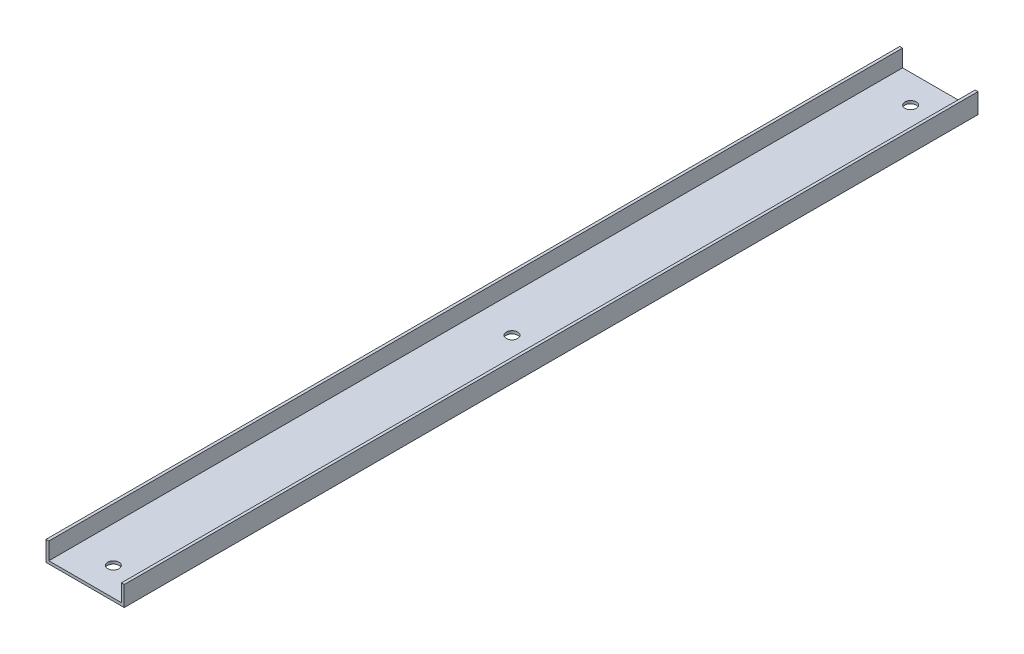
ISO-10303-21;
HEADER;
FILE_DESCRIPTION(('STEP AP214'),'2;1');
FILE_NAME('part.step','',(''),(''),'','','');
FILE_SCHEMA(('AUTOMOTIVE_DESIGN { 1 0 10303 214 1 1 1 1 }'));
ENDSEC;
DATA;
#1=APPLICATION_CONTEXT('core data for automotive mechanical design processes');
#2=APPLICATION_PROTOCOL_DEFINITION('international standard','automotive_design',2000,#1);
#3=PRODUCT_CONTEXT('',#1,'mechanical');
#4=PRODUCT('Part','Part','',(#3));
#5=PRODUCT_RELATED_PRODUCT_CATEGORY('part','',(#4));
#6=PRODUCT_DEFINITION_FORMATION('','',#4);
#7=PRODUCT_DEFINITION_CONTEXT('part definition',#1,'design');
#8=PRODUCT_DEFINITION('design','',#6,#7);
#9=PRODUCT_DEFINITION_SHAPE('','',#8);
#10=(LENGTH_UNIT() NAMED_UNIT(*) SI_UNIT(.MILLI.,.METRE.));
#11=(NAMED_UNIT(*) PLANE_ANGLE_UNIT() SI_UNIT($,.RADIAN.));
#12=(NAMED_UNIT(*) SI_UNIT($,.STERADIAN.) SOLID_ANGLE_UNIT());
#13=UNCERTAINTY_MEASURE_WITH_UNIT(LENGTH_MEASURE(1.E-05),#10,'distance_accuracy_value','');
#14=(GEOMETRIC_REPRESENTATION_CONTEXT(3) GLOBAL_UNCERTAINTY_ASSIGNED_CONTEXT((#13)) GLOBAL_UNIT_ASSIGNED_CONTEXT((#10,
#11,#12)) REPRESENTATION_CONTEXT('',''));
#15=CARTESIAN_POINT('',(0.,0.,0.));
#16=DIRECTION('',(0.,0.,1.));
#17=DIRECTION('',(1.,0.,0.));
#18=AXIS2_PLACEMENT_3D('',#15,#16,#17);
#19=CARTESIAN_POINT('',(1.27,0.,384.175));
#20=DIRECTION('',(0.,-1.,0.));
#21=DIRECTION('',(0.,0.,-1.));
#22=AXIS2_PLACEMENT_3D('',#19,#20,#21);
#23=PLANE('',#22);
#24=DIRECTION('',(-1.,0.,0.));
#25=VECTOR('',#24,1.);
#26=CARTESIAN_POINT('',(1.27,0.,0.));
#27=LINE('',#26,#25);
#28=CARTESIAN_POINT('',(1.27,0.,0.));
#29=VERTEX_POINT('',#28);
#30=CARTESIAN_POINT('',(0.,0.,0.));
#31=VERTEX_POINT('',#30);
#32=EDGE_CURVE('E129',#29,#31,#27,.T.);
#33=ORIENTED_EDGE('',*,*,#32,.T.);
#34=DIRECTION('',(0.,0.,-1.));
#35=VECTOR('',#34,1.);
#36=CARTESIAN_POINT('',(0.,0.,384.175));
#37=LINE('',#36,#35);
#38=CARTESIAN_POINT('',(0.,0.,384.175));
#39=VERTEX_POINT('',#38);
#40=EDGE_CURVE('E11',#39,#31,#37,.T.);
#41=ORIENTED_EDGE('',*,*,#40,.F.);
#42=DIRECTION('',(-1.,0.,0.));
#43=VECTOR('',#42,1.);
#44=CARTESIAN_POINT('',(1.27,0.,384.175));
#45=LINE('',#44,#43);
#46=CARTESIAN_POINT('',(1.27,0.,384.175));
#47=VERTEX_POINT('',#46);
#48=EDGE_CURVE('E144',#47,#39,#45,.T.);
#49=ORIENTED_EDGE('',*,*,#48,.F.);
#50=DIRECTION('',(0.,0.,-1.));
#51=VECTOR('',#50,1.);
#52=CARTESIAN_POINT('',(1.27,0.,384.175));
#53=LINE('',#52,#51);
#54=EDGE_CURVE('E125',#47,#29,#53,.T.);
#55=ORIENTED_EDGE('',*,*,#54,.T.);
#56=EDGE_LOOP('',(#33,#41,#49,#55));
#57=FACE_BOUND('',#56,.T.);
#58=ADVANCED_FACE('F33',(#57),#23,.F.);
#59=CARTESIAN_POINT('',(0.,0.,384.175));
#60=DIRECTION('',(1.,0.,0.));
#61=DIRECTION('',(0.,1.,0.));
#62=AXIS2_PLACEMENT_3D('',#59,#60,#61);
#63=PLANE('',#62);
#64=DIRECTION('',(0.,-1.,0.));
#65=VECTOR('',#64,1.);
#66=CARTESIAN_POINT('',(0.,0.,0.));
#67=LINE('',#66,#65);
#68=CARTESIAN_POINT('',(0.,-8.9916,0.));
#69=VERTEX_POINT('',#68);
#70=EDGE_CURVE('E132',#31,#69,#67,.T.);
#71=ORIENTED_EDGE('',*,*,#70,.T.);
#72=DIRECTION('',(0.,0.,-1.));
#73=VECTOR('',#72,1.);
#74=CARTESIAN_POINT('',(0.,-8.9916,384.175));
#75=LINE('',#74,#73);
#76=CARTESIAN_POINT('',(0.,-8.9916,384.175));
#77=VERTEX_POINT('',#76);
#78=EDGE_CURVE('E41',#77,#69,#75,.T.);
#79=ORIENTED_EDGE('',*,*,#78,.F.);
#80=DIRECTION('',(0.,-1.,0.));
#81=VECTOR('',#80,1.);
#82=CARTESIAN_POINT('',(0.,0.,384.175));
#83=LINE('',#82,#81);
#84=EDGE_CURVE('E92',#39,#77,#83,.T.);
#85=ORIENTED_EDGE('',*,*,#84,.F.);
#86=ORIENTED_EDGE('',*,*,#40,.T.);
#87=EDGE_LOOP('',(#71,#79,#85,#86));
#88=FACE_BOUND('',#87,.T.);
#89=ADVANCED_FACE('F206',(#88),#63,.F.);
#90=CARTESIAN_POINT('',(0.,-8.9916,384.175));
#91=DIRECTION('',(0.,1.,0.));
#92=DIRECTION('',(-1.,0.,0.));
#93=AXIS2_PLACEMENT_3D('',#90,#91,#92);
#94=PLANE('',#93);
#95=CARTESIAN_POINT('',(17.6022,-8.9916,371.475));
#96=DIRECTION('',(0.,-1.,0.));
#97=DIRECTION('',(0.,0.,-1.));
#98=AXIS2_PLACEMENT_3D('',#95,#96,#97);
#99=CIRCLE('',#98,2.54000000000001);
#100=CARTESIAN_POINT('',(17.6022,-8.9916,368.935));
#101=VERTEX_POINT('',#100);
#102=EDGE_CURVE('E189',#101,#101,#99,.T.);
#103=ORIENTED_EDGE('',*,*,#102,.F.);
#104=EDGE_LOOP('',(#103));
#105=FACE_BOUND('',#104,.T.);
#106=CARTESIAN_POINT('',(17.6022,-8.9916,192.0875));
#107=DIRECTION('',(0.,-1.,0.));
#108=DIRECTION('',(0.,0.,-1.));
#109=AXIS2_PLACEMENT_3D('',#106,#107,#108);
#110=CIRCLE('',#109,2.54);
#111=CARTESIAN_POINT('',(17.6022,-8.9916,189.5475));
#112=VERTEX_POINT('',#111);
#113=EDGE_CURVE('E183',#112,#112,#110,.T.);
#114=ORIENTED_EDGE('',*,*,#113,.F.);
#115=EDGE_LOOP('',(#114));
#116=FACE_BOUND('',#115,.T.);
#117=CARTESIAN_POINT('',(17.6022,-8.9916,12.7));
#118=DIRECTION('',(0.,-1.,0.));
#119=DIRECTION('',(0.,0.,-1.));
#120=AXIS2_PLACEMENT_3D('',#117,#118,#119);
#121=CIRCLE('',#120,2.54);
#122=CARTESIAN_POINT('',(17.6022,-8.9916,10.16));
#123=VERTEX_POINT('',#122);
#124=EDGE_CURVE('E177',#123,#123,#121,.T.);
#125=ORIENTED_EDGE('',*,*,#124,.F.);
#126=EDGE_LOOP('',(#125));
#127=FACE_BOUND('',#126,.T.);
#128=DIRECTION('',(1.,0.,0.));
#129=VECTOR('',#128,1.);
#130=CARTESIAN_POINT('',(0.,-8.9916,0.));
#131=LINE('',#130,#129);
#132=CARTESIAN_POINT('',(35.2044,-8.99159999999999,0.));
#133=VERTEX_POINT('',#132);
#134=EDGE_CURVE('E135',#69,#133,#131,.T.);
#135=ORIENTED_EDGE('',*,*,#134,.T.);
#136=DIRECTION('',(0.,0.,-1.));
#137=VECTOR('',#136,1.);
#138=CARTESIAN_POINT('',(35.2044,-8.99159999999999,384.175));
#139=LINE('',#138,#137);
#140=CARTESIAN_POINT('',(35.2044,-8.99159999999999,384.175));
#141=VERTEX_POINT('',#140);
#142=EDGE_CURVE('E151',#141,#133,#139,.T.);
#143=ORIENTED_EDGE('',*,*,#142,.F.);
#144=DIRECTION('',(1.,0.,0.));
#145=VECTOR('',#144,1.);
#146=CARTESIAN_POINT('',(0.,-8.9916,384.175));
#147=LINE('',#146,#145);
#148=EDGE_CURVE('E159',#77,#141,#147,.T.);
#149=ORIENTED_EDGE('',*,*,#148,.F.);
#150=ORIENTED_EDGE('',*,*,#78,.T.);
#151=EDGE_LOOP('',(#135,#143,#149,#150));
#152=FACE_BOUND('',#151,.T.);
#153=ADVANCED_FACE('F157',(#105,#116,#127,#152),#94,.F.);
#154=CARTESIAN_POINT('',(35.2044,-8.99159999999999,384.175));
#155=DIRECTION('',(-1.,0.,0.));
#156=DIRECTION('',(0.,-1.,0.));
#157=AXIS2_PLACEMENT_3D('',#154,#155,#156);
#158=PLANE('',#157);
#159=DIRECTION('',(0.,1.,0.));
#160=VECTOR('',#159,1.);
#161=CARTESIAN_POINT('',(35.2044,-8.99159999999999,0.));
#162=LINE('',#161,#160);
#163=CARTESIAN_POINT('',(35.2044,0.,0.));
#164=VERTEX_POINT('',#163);
#165=EDGE_CURVE('E137',#133,#164,#162,.T.);
#166=ORIENTED_EDGE('',*,*,#165,.T.);
#167=DIRECTION('',(0.,0.,-1.));
#168=VECTOR('',#167,1.);
#169=CARTESIAN_POINT('',(35.2044,0.,384.175));
#170=LINE('',#169,#168);
#171=CARTESIAN_POINT('',(35.2044,0.,384.175));
#172=VERTEX_POINT('',#171);
#173=EDGE_CURVE('E148',#172,#164,#170,.T.);
#174=ORIENTED_EDGE('',*,*,#173,.F.);
#175=DIRECTION('',(0.,1.,0.));
#176=VECTOR('',#175,1.);
#177=CARTESIAN_POINT('',(35.2044,-8.99159999999999,384.175));
#178=LINE('',#177,#176);
#179=EDGE_CURVE('E171',#141,#172,#178,.T.);
#180=ORIENTED_EDGE('',*,*,#179,.F.);
#181=ORIENTED_EDGE('',*,*,#142,.T.);
#182=EDGE_LOOP('',(#166,#174,#180,#181));
#183=FACE_BOUND('',#182,.T.);
#184=ADVANCED_FACE('F167',(#183),#158,.F.);
#185=CARTESIAN_POINT('',(35.2044,0.,384.175));
#186=DIRECTION('',(0.,-1.,0.));
#187=DIRECTION('',(1.,0.,0.));
#188=AXIS2_PLACEMENT_3D('',#185,#186,#187);
#189=PLANE('',#188);
#190=DIRECTION('',(-1.,0.,0.));
#191=VECTOR('',#190,1.);
#192=CARTESIAN_POINT('',(35.2044,0.,0.));
#193=LINE('',#192,#191);
#194=CARTESIAN_POINT('',(33.9344,0.,0.));
#195=VERTEX_POINT('',#194);
#196=EDGE_CURVE('E139',#164,#195,#193,.T.);
#197=ORIENTED_EDGE('',*,*,#196,.T.);
#198=DIRECTION('',(0.,0.,-1.));
#199=VECTOR('',#198,1.);
#200=CARTESIAN_POINT('',(33.9344,0.,384.175));
#201=LINE('',#200,#199);
#202=CARTESIAN_POINT('',(33.9344,0.,384.175));
#203=VERTEX_POINT('',#202);
#204=EDGE_CURVE('E120',#203,#195,#201,.T.);
#205=ORIENTED_EDGE('',*,*,#204,.F.);
#206=DIRECTION('',(-1.,0.,0.));
#207=VECTOR('',#206,1.);
#208=CARTESIAN_POINT('',(35.2044,0.,384.175));
#209=LINE('',#208,#207);
#210=EDGE_CURVE('E111',#172,#203,#209,.T.);
#211=ORIENTED_EDGE('',*,*,#210,.F.);
#212=ORIENTED_EDGE('',*,*,#173,.T.);
#213=EDGE_LOOP('',(#197,#205,#211,#212));
#214=FACE_BOUND('',#213,.T.);
#215=ADVANCED_FACE('F170',(#214),#189,.F.);
#216=CARTESIAN_POINT('',(33.9344,0.,384.175));
#217=DIRECTION('',(1.,0.,0.));
#218=DIRECTION('',(0.,0.,-1.));
#219=AXIS2_PLACEMENT_3D('',#216,#217,#218);
#220=PLANE('',#219);
#221=DIRECTION('',(0.,-1.,0.));
#222=VECTOR('',#221,1.);
#223=CARTESIAN_POINT('',(33.9344,0.,0.));
#224=LINE('',#223,#222);
#225=CARTESIAN_POINT('',(33.9344,-7.7216,0.));
#226=VERTEX_POINT('',#225);
#227=EDGE_CURVE('E119',#195,#226,#224,.T.);
#228=ORIENTED_EDGE('',*,*,#227,.T.);
#229=DIRECTION('',(0.,0.,-1.));
#230=VECTOR('',#229,1.);
#231=CARTESIAN_POINT('',(33.9344,-7.7216,384.175));
#232=LINE('',#231,#230);
#233=CARTESIAN_POINT('',(33.9344,-7.7216,384.175));
#234=VERTEX_POINT('',#233);
#235=EDGE_CURVE('E116',#234,#226,#232,.T.);
#236=ORIENTED_EDGE('',*,*,#235,.F.);
#237=DIRECTION('',(0.,-1.,0.));
#238=VECTOR('',#237,1.);
#239=CARTESIAN_POINT('',(33.9344,0.,384.175));
#240=LINE('',#239,#238);
#241=EDGE_CURVE('E105',#203,#234,#240,.T.);
#242=ORIENTED_EDGE('',*,*,#241,.F.);
#243=ORIENTED_EDGE('',*,*,#204,.T.);
#244=EDGE_LOOP('',(#228,#236,#242,#243));
#245=FACE_BOUND('',#244,.T.);
#246=ADVANCED_FACE('F117',(#245),#220,.F.);
#247=CARTESIAN_POINT('',(33.9344,-7.7216,384.175));
#248=DIRECTION('',(0.,-1.,0.));
#249=DIRECTION('',(1.,0.,0.));
#250=AXIS2_PLACEMENT_3D('',#247,#248,#249);
#251=PLANE('',#250);
#252=CARTESIAN_POINT('',(17.6022,-7.7216,371.475));
#253=DIRECTION('',(0.,-1.,0.));
#254=DIRECTION('',(0.,0.,-1.));
#255=AXIS2_PLACEMENT_3D('',#252,#253,#254);
#256=CIRCLE('',#255,2.54000000000001);
#257=CARTESIAN_POINT('',(17.6022,-7.7216,368.935));
#258=VERTEX_POINT('',#257);
#259=EDGE_CURVE('E186',#258,#258,#256,.T.);
#260=ORIENTED_EDGE('',*,*,#259,.T.);
#261=EDGE_LOOP('',(#260));
#262=FACE_BOUND('',#261,.T.);
#263=CARTESIAN_POINT('',(17.6022,-7.7216,192.0875));
#264=DIRECTION('',(0.,-1.,0.));
#265=DIRECTION('',(0.,0.,-1.));
#266=AXIS2_PLACEMENT_3D('',#263,#264,#265);
#267=CIRCLE('',#266,2.54);
#268=CARTESIAN_POINT('',(17.6022,-7.7216,189.5475));
#269=VERTEX_POINT('',#268);
#270=EDGE_CURVE('E180',#269,#269,#267,.T.);
#271=ORIENTED_EDGE('',*,*,#270,.T.);
#272=EDGE_LOOP('',(#271));
#273=FACE_BOUND('',#272,.T.);
#274=CARTESIAN_POINT('',(17.6022,-7.7216,12.7));
#275=DIRECTION('',(0.,-1.,0.));
#276=DIRECTION('',(0.,0.,-1.));
#277=AXIS2_PLACEMENT_3D('',#274,#275,#276);
#278=CIRCLE('',#277,2.54);
#279=CARTESIAN_POINT('',(17.6022,-7.7216,10.16));
#280=VERTEX_POINT('',#279);
#281=EDGE_CURVE('E133',#280,#280,#278,.T.);
#282=ORIENTED_EDGE('',*,*,#281,.T.);
#283=EDGE_LOOP('',(#282));
#284=FACE_BOUND('',#283,.T.);
#285=DIRECTION('',(-1.,0.,0.));
#286=VECTOR('',#285,1.);
#287=CARTESIAN_POINT('',(33.9344,-7.7216,0.));
#288=LINE('',#287,#286);
#289=CARTESIAN_POINT('',(1.27,-7.72160000000001,0.));
#290=VERTEX_POINT('',#289);
#291=EDGE_CURVE('E78',#226,#290,#288,.T.);
#292=ORIENTED_EDGE('',*,*,#291,.T.);
#293=DIRECTION('',(0.,0.,-1.));
#294=VECTOR('',#293,1.);
#295=CARTESIAN_POINT('',(1.27,-7.72160000000001,384.175));
#296=LINE('',#295,#294);
#297=CARTESIAN_POINT('',(1.27,-7.72160000000001,384.175));
#298=VERTEX_POINT('',#297);
#299=EDGE_CURVE('E121',#298,#290,#296,.T.);
#300=ORIENTED_EDGE('',*,*,#299,.F.);
#301=DIRECTION('',(-1.,0.,0.));
#302=VECTOR('',#301,1.);
#303=CARTESIAN_POINT('',(33.9344,-7.7216,384.175));
#304=LINE('',#303,#302);
#305=EDGE_CURVE('E109',#234,#298,#304,.T.);
#306=ORIENTED_EDGE('',*,*,#305,.F.);
#307=ORIENTED_EDGE('',*,*,#235,.T.);
#308=EDGE_LOOP('',(#292,#300,#306,#307));
#309=FACE_BOUND('',#308,.T.);
#310=ADVANCED_FACE('F123',(#262,#273,#284,#309),#251,.F.);
#311=CARTESIAN_POINT('',(1.27,-7.72160000000001,384.175));
#312=DIRECTION('',(-1.,0.,0.));
#313=DIRECTION('',(0.,-1.,0.));
#314=AXIS2_PLACEMENT_3D('',#311,#312,#313);
#315=PLANE('',#314);
#316=DIRECTION('',(0.,1.,0.));
#317=VECTOR('',#316,1.);
#318=CARTESIAN_POINT('',(1.27,-7.72160000000001,0.));
#319=LINE('',#318,#317);
#320=EDGE_CURVE('E84',#290,#29,#319,.T.);
#321=ORIENTED_EDGE('',*,*,#320,.T.);
#322=ORIENTED_EDGE('',*,*,#54,.F.);
#323=DIRECTION('',(0.,1.,0.));
#324=VECTOR('',#323,1.);
#325=CARTESIAN_POINT('',(1.27,-7.72160000000001,384.175));
#326=LINE('',#325,#324);
#327=EDGE_CURVE('E49',#298,#47,#326,.T.);
#328=ORIENTED_EDGE('',*,*,#327,.F.);
#329=ORIENTED_EDGE('',*,*,#299,.T.);
#330=EDGE_LOOP('',(#321,#322,#328,#329));
#331=FACE_BOUND('',#330,.T.);
#332=ADVANCED_FACE('F232',(#331),#315,.F.);
#333=CARTESIAN_POINT('',(0.,0.,384.175));
#334=DIRECTION('',(0.,0.,1.));
#335=DIRECTION('',(1.,0.,0.));
#336=AXIS2_PLACEMENT_3D('',#333,#334,#335);
#337=PLANE('',#336);
#338=ORIENTED_EDGE('',*,*,#48,.T.);
#339=ORIENTED_EDGE('',*,*,#84,.T.);
#340=ORIENTED_EDGE('',*,*,#148,.T.);
#341=ORIENTED_EDGE('',*,*,#179,.T.);
#342=ORIENTED_EDGE('',*,*,#210,.T.);
#343=ORIENTED_EDGE('',*,*,#241,.T.);
#344=ORIENTED_EDGE('',*,*,#305,.T.);
#345=ORIENTED_EDGE('',*,*,#327,.T.);
#346=EDGE_LOOP('',(#338,#339,#340,#341,#342,#343,#344,#345));
#347=FACE_BOUND('',#346,.T.);
#348=ADVANCED_FACE('F107',(#347),#337,.T.);
#349=CARTESIAN_POINT('',(0.,0.,0.));
#350=DIRECTION('',(0.,0.,1.));
#351=DIRECTION('',(1.,0.,0.));
#352=AXIS2_PLACEMENT_3D('',#349,#350,#351);
#353=PLANE('',#352);
#354=ORIENTED_EDGE('',*,*,#32,.F.);
#355=ORIENTED_EDGE('',*,*,#320,.F.);
#356=ORIENTED_EDGE('',*,*,#291,.F.);
#357=ORIENTED_EDGE('',*,*,#227,.F.);
#358=ORIENTED_EDGE('',*,*,#196,.F.);
#359=ORIENTED_EDGE('',*,*,#165,.F.);
#360=ORIENTED_EDGE('',*,*,#134,.F.);
#361=ORIENTED_EDGE('',*,*,#70,.F.);
#362=EDGE_LOOP('',(#354,#355,#356,#357,#358,#359,#360,#361));
#363=FACE_BOUND('',#362,.T.);
#364=ADVANCED_FACE('F163',(#363),#353,.F.);
#365=CARTESIAN_POINT('',(17.6022,-7.7216,12.7));
#366=DIRECTION('',(0.,-1.,0.));
#367=DIRECTION('',(0.,0.,-1.));
#368=AXIS2_PLACEMENT_3D('',#365,#366,#367);
#369=CYLINDRICAL_SURFACE('',#368,2.54);
#370=ORIENTED_EDGE('',*,*,#281,.F.);
#371=EDGE_LOOP('',(#370));
#372=FACE_BOUND('',#371,.T.);
#373=ORIENTED_EDGE('',*,*,#124,.T.);
#374=EDGE_LOOP('',(#373));
#375=FACE_BOUND('',#374,.T.);
#376=ADVANCED_FACE('F212',(#372,#375),#369,.F.);
#377=CARTESIAN_POINT('',(17.6022,-7.7216,192.0875));
#378=DIRECTION('',(0.,-1.,0.));
#379=DIRECTION('',(0.,0.,-1.));
#380=AXIS2_PLACEMENT_3D('',#377,#378,#379);
#381=CYLINDRICAL_SURFACE('',#380,2.54);
#382=ORIENTED_EDGE('',*,*,#270,.F.);
#383=EDGE_LOOP('',(#382));
#384=FACE_BOUND('',#383,.T.);
#385=ORIENTED_EDGE('',*,*,#113,.T.);
#386=EDGE_LOOP('',(#385));
#387=FACE_BOUND('',#386,.T.);
#388=ADVANCED_FACE('F200',(#384,#387),#381,.F.);
#389=CARTESIAN_POINT('',(17.6022,-7.7216,371.475));
#390=DIRECTION('',(0.,-1.,0.));
#391=DIRECTION('',(0.,0.,-1.));
#392=AXIS2_PLACEMENT_3D('',#389,#390,#391);
#393=CYLINDRICAL_SURFACE('',#392,2.54000000000001);
#394=ORIENTED_EDGE('',*,*,#259,.F.);
#395=EDGE_LOOP('',(#394));
#396=FACE_BOUND('',#395,.T.);
#397=ORIENTED_EDGE('',*,*,#102,.T.);
#398=EDGE_LOOP('',(#397));
#399=FACE_BOUND('',#398,.T.);
#400=ADVANCED_FACE('F197',(#396,#399),#393,.F.);
#401=CLOSED_SHELL('',(#58,#89,#153,#184,#215,#246,#310,#332,#348,#364,#376,#388,#400));
#402=MANIFOLD_SOLID_BREP('B2',#401);
#403=ADVANCED_BREP_SHAPE_REPRESENTATION('',(#18,#402),#14);
#404=SHAPE_DEFINITION_REPRESENTATION(#9,#403);
ENDSEC;
END-ISO-10303-21;
